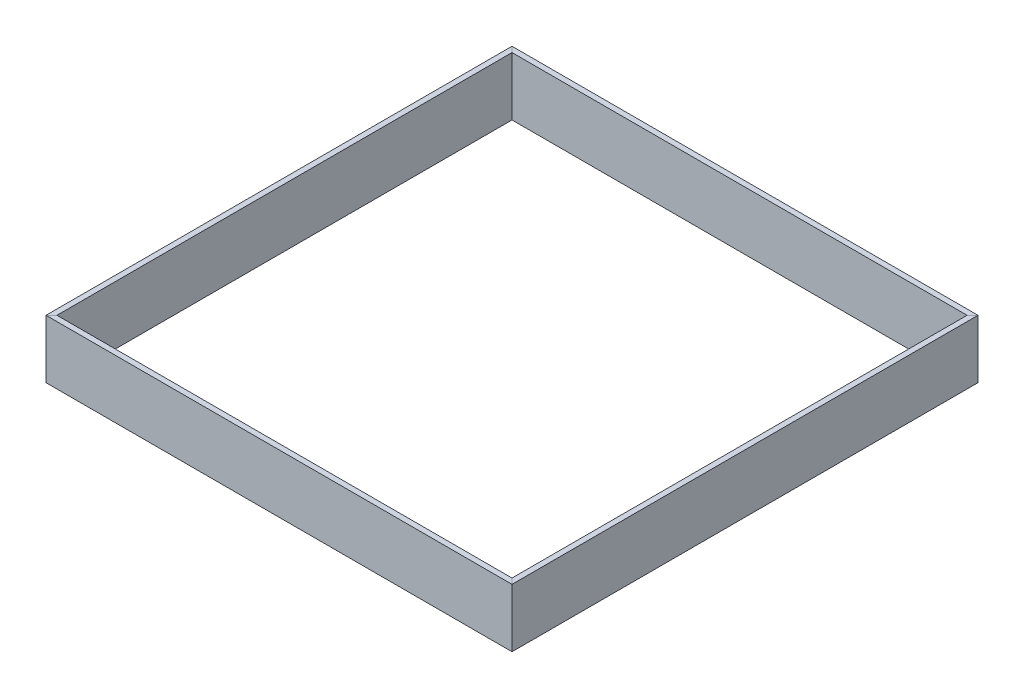
ISO-10303-21;
HEADER;
FILE_DESCRIPTION(('STEP AP214'),'2;1');
FILE_NAME('part.step','',(''),(''),'','','');
FILE_SCHEMA(('AUTOMOTIVE_DESIGN { 1 0 10303 214 1 1 1 1 }'));
ENDSEC;
DATA;
#1=APPLICATION_CONTEXT('core data for automotive mechanical design processes');
#2=APPLICATION_PROTOCOL_DEFINITION('international standard','automotive_design',2000,#1);
#3=PRODUCT_CONTEXT('',#1,'mechanical');
#4=PRODUCT('Part','Part','',(#3));
#5=PRODUCT_RELATED_PRODUCT_CATEGORY('part','',(#4));
#6=PRODUCT_DEFINITION_FORMATION('','',#4);
#7=PRODUCT_DEFINITION_CONTEXT('part definition',#1,'design');
#8=PRODUCT_DEFINITION('design','',#6,#7);
#9=PRODUCT_DEFINITION_SHAPE('','',#8);
#10=(LENGTH_UNIT() NAMED_UNIT(*) SI_UNIT(.MILLI.,.METRE.));
#11=(NAMED_UNIT(*) PLANE_ANGLE_UNIT() SI_UNIT($,.RADIAN.));
#12=(NAMED_UNIT(*) SI_UNIT($,.STERADIAN.) SOLID_ANGLE_UNIT());
#13=UNCERTAINTY_MEASURE_WITH_UNIT(LENGTH_MEASURE(1.E-05),#10,'distance_accuracy_value','');
#14=(GEOMETRIC_REPRESENTATION_CONTEXT(3) GLOBAL_UNCERTAINTY_ASSIGNED_CONTEXT((#13)) GLOBAL_UNIT_ASSIGNED_CONTEXT((#10,
#11,#12)) REPRESENTATION_CONTEXT('',''));
#15=CARTESIAN_POINT('',(0.,0.,0.));
#16=DIRECTION('',(0.,0.,1.));
#17=DIRECTION('',(1.,0.,0.));
#18=AXIS2_PLACEMENT_3D('',#15,#16,#17);
#19=CARTESIAN_POINT('',(-400.62,0.,400.62));
#20=DIRECTION('',(0.707106781186548,0.,0.707106781186548));
#21=DIRECTION('',(0.,-1.,0.));
#22=AXIS2_PLACEMENT_3D('',#19,#20,#21);
#23=PLANE('',#22);
#24=DIRECTION('',(-0.707106781186548,0.,0.707106781186548));
#25=VECTOR('',#24,1.);
#26=CARTESIAN_POINT('',(-2.38124999999989,50.8,2.38124999999995));
#27=LINE('',#26,#25);
#28=CARTESIAN_POINT('',(-395.8575,50.8,395.8575));
#29=VERTEX_POINT('',#28);
#30=CARTESIAN_POINT('',(-405.3825,50.8,405.3825));
#31=VERTEX_POINT('',#30);
#32=EDGE_CURVE('P0_E92',#29,#31,#27,.T.);
#33=ORIENTED_EDGE('',*,*,#32,.T.);
#34=DIRECTION('',(0.,-1.,0.));
#35=VECTOR('',#34,1.);
#36=CARTESIAN_POINT('',(-405.3825,50.8,405.3825));
#37=LINE('',#36,#35);
#38=CARTESIAN_POINT('',(-405.3825,-50.8,405.3825));
#39=VERTEX_POINT('',#38);
#40=EDGE_CURVE('P0_E103',#31,#39,#37,.T.);
#41=ORIENTED_EDGE('',*,*,#40,.T.);
#42=DIRECTION('',(0.707106781186548,0.,-0.707106781186548));
#43=VECTOR('',#42,1.);
#44=CARTESIAN_POINT('',(2.38125000000012,-50.8,-2.38125000000006));
#45=LINE('',#44,#43);
#46=CARTESIAN_POINT('',(-395.8575,-50.8,395.8575));
#47=VERTEX_POINT('',#46);
#48=EDGE_CURVE('P0_E27',#39,#47,#45,.T.);
#49=ORIENTED_EDGE('',*,*,#48,.T.);
#50=DIRECTION('',(0.,1.,0.));
#51=VECTOR('',#50,1.);
#52=CARTESIAN_POINT('',(-395.8575,-50.8,395.8575));
#53=LINE('',#52,#51);
#54=EDGE_CURVE('P0_E62',#47,#29,#53,.T.);
#55=ORIENTED_EDGE('',*,*,#54,.T.);
#56=EDGE_LOOP('',(#33,#41,#49,#55));
#57=FACE_BOUND('',#56,.T.);
#58=ADVANCED_FACE('P0_F17',(#57),#23,.T.);
#59=CARTESIAN_POINT('',(-400.62,0.,-400.62));
#60=DIRECTION('',(0.707106781186548,0.,-0.707106781186548));
#61=DIRECTION('',(0.,-1.,0.));
#62=AXIS2_PLACEMENT_3D('',#59,#60,#61);
#63=PLANE('',#62);
#64=DIRECTION('',(-0.707106781186548,0.,-0.707106781186548));
#65=VECTOR('',#64,1.);
#66=CARTESIAN_POINT('',(-398.23875,-50.8,-398.23875));
#67=LINE('',#66,#65);
#68=CARTESIAN_POINT('',(-395.8575,-50.8,-395.8575));
#69=VERTEX_POINT('',#68);
#70=CARTESIAN_POINT('',(-405.3825,-50.8,-405.3825));
#71=VERTEX_POINT('',#70);
#72=EDGE_CURVE('P0_E11',#69,#71,#67,.T.);
#73=ORIENTED_EDGE('',*,*,#72,.T.);
#74=DIRECTION('',(0.,1.,0.));
#75=VECTOR('',#74,1.);
#76=CARTESIAN_POINT('',(-405.3825,50.8,-405.3825));
#77=LINE('',#76,#75);
#78=CARTESIAN_POINT('',(-405.3825,50.8,-405.3825));
#79=VERTEX_POINT('',#78);
#80=EDGE_CURVE('P0_E85',#71,#79,#77,.T.);
#81=ORIENTED_EDGE('',*,*,#80,.T.);
#82=DIRECTION('',(0.707106781186548,0.,0.707106781186548));
#83=VECTOR('',#82,1.);
#84=CARTESIAN_POINT('',(-403.00125,50.8,-403.00125));
#85=LINE('',#84,#83);
#86=CARTESIAN_POINT('',(-395.8575,50.8,-395.8575));
#87=VERTEX_POINT('',#86);
#88=EDGE_CURVE('P0_E82',#79,#87,#85,.T.);
#89=ORIENTED_EDGE('',*,*,#88,.T.);
#90=DIRECTION('',(0.,-1.,0.));
#91=VECTOR('',#90,1.);
#92=CARTESIAN_POINT('',(-395.8575,-50.8,-395.8575));
#93=LINE('',#92,#91);
#94=EDGE_CURVE('P0_E70',#87,#69,#93,.T.);
#95=ORIENTED_EDGE('',*,*,#94,.T.);
#96=EDGE_LOOP('',(#73,#81,#89,#95));
#97=FACE_BOUND('',#96,.T.);
#98=ADVANCED_FACE('P0_F83',(#97),#63,.T.);
#99=CARTESIAN_POINT('',(-395.8575,-50.8,-400.62));
#100=DIRECTION('',(0.,1.,0.));
#101=DIRECTION('',(1.,0.,0.));
#102=AXIS2_PLACEMENT_3D('',#99,#100,#101);
#103=PLANE('',#102);
#104=ORIENTED_EDGE('',*,*,#48,.F.);
#105=DIRECTION('',(0.,0.,1.));
#106=VECTOR('',#105,1.);
#107=CARTESIAN_POINT('',(-405.3825,-50.8,-400.62));
#108=LINE('',#107,#106);
#109=EDGE_CURVE('P0_E100',#71,#39,#108,.T.);
#110=ORIENTED_EDGE('',*,*,#109,.F.);
#111=ORIENTED_EDGE('',*,*,#72,.F.);
#112=DIRECTION('',(0.,0.,1.));
#113=VECTOR('',#112,1.);
#114=CARTESIAN_POINT('',(-395.8575,-50.8,-400.62));
#115=LINE('',#114,#113);
#116=EDGE_CURVE('P0_E76',#69,#47,#115,.T.);
#117=ORIENTED_EDGE('',*,*,#116,.T.);
#118=EDGE_LOOP('',(#104,#110,#111,#117));
#119=FACE_BOUND('',#118,.T.);
#120=ADVANCED_FACE('P0_F19',(#119),#103,.F.);
#121=CARTESIAN_POINT('',(-395.8575,-50.8,-400.62));
#122=DIRECTION('',(-1.,0.,0.));
#123=DIRECTION('',(0.,0.,1.));
#124=AXIS2_PLACEMENT_3D('',#121,#122,#123);
#125=PLANE('',#124);
#126=ORIENTED_EDGE('',*,*,#54,.F.);
#127=ORIENTED_EDGE('',*,*,#116,.F.);
#128=ORIENTED_EDGE('',*,*,#94,.F.);
#129=DIRECTION('',(0.,0.,1.));
#130=VECTOR('',#129,1.);
#131=CARTESIAN_POINT('',(-395.8575,50.8,-400.62));
#132=LINE('',#131,#130);
#133=EDGE_CURVE('P0_E74',#87,#29,#132,.T.);
#134=ORIENTED_EDGE('',*,*,#133,.T.);
#135=EDGE_LOOP('',(#126,#127,#128,#134));
#136=FACE_BOUND('',#135,.T.);
#137=ADVANCED_FACE('P0_F72',(#136),#125,.F.);
#138=CARTESIAN_POINT('',(-405.3825,50.8,-400.62));
#139=DIRECTION('',(0.,-1.,0.));
#140=DIRECTION('',(0.,0.,-1.));
#141=AXIS2_PLACEMENT_3D('',#138,#139,#140);
#142=PLANE('',#141);
#143=ORIENTED_EDGE('',*,*,#32,.F.);
#144=ORIENTED_EDGE('',*,*,#133,.F.);
#145=ORIENTED_EDGE('',*,*,#88,.F.);
#146=DIRECTION('',(0.,0.,1.));
#147=VECTOR('',#146,1.);
#148=CARTESIAN_POINT('',(-405.3825,50.8,-400.62));
#149=LINE('',#148,#147);
#150=EDGE_CURVE('P0_E110',#79,#31,#149,.T.);
#151=ORIENTED_EDGE('',*,*,#150,.T.);
#152=EDGE_LOOP('',(#143,#144,#145,#151));
#153=FACE_BOUND('',#152,.T.);
#154=ADVANCED_FACE('P0_F91',(#153),#142,.F.);
#155=CARTESIAN_POINT('',(-405.3825,50.8,-400.62));
#156=DIRECTION('',(1.,0.,0.));
#157=DIRECTION('',(0.,1.,0.));
#158=AXIS2_PLACEMENT_3D('',#155,#156,#157);
#159=PLANE('',#158);
#160=ORIENTED_EDGE('',*,*,#40,.F.);
#161=ORIENTED_EDGE('',*,*,#150,.F.);
#162=ORIENTED_EDGE('',*,*,#80,.F.);
#163=ORIENTED_EDGE('',*,*,#109,.T.);
#164=EDGE_LOOP('',(#160,#161,#162,#163));
#165=FACE_BOUND('',#164,.T.);
#166=ADVANCED_FACE('P0_F123',(#165),#159,.F.);
#167=CLOSED_SHELL('',(#58,#98,#120,#137,#154,#166));
#168=MANIFOLD_SOLID_BREP('P0_B1',#167);
#169=CARTESIAN_POINT('',(-400.62,0.,-400.62));
#170=DIRECTION('',(-0.707106781186548,0.,0.707106781186548));
#171=DIRECTION('',(0.,1.,0.));
#172=AXIS2_PLACEMENT_3D('',#169,#170,#171);
#173=PLANE('',#172);
#174=DIRECTION('',(-0.707106781186548,0.,-0.707106781186548));
#175=VECTOR('',#174,1.);
#176=CARTESIAN_POINT('',(-2.38125,50.8,-2.38125));
#177=LINE('',#176,#175);
#178=CARTESIAN_POINT('',(-395.8575,50.8,-395.8575));
#179=VERTEX_POINT('',#178);
#180=CARTESIAN_POINT('',(-405.3825,50.8,-405.3825));
#181=VERTEX_POINT('',#180);
#182=EDGE_CURVE('P1_E72',#179,#181,#177,.T.);
#183=ORIENTED_EDGE('',*,*,#182,.T.);
#184=DIRECTION('',(0.,-1.,0.));
#185=VECTOR('',#184,1.);
#186=CARTESIAN_POINT('',(-405.3825,50.8,-405.3825));
#187=LINE('',#186,#185);
#188=CARTESIAN_POINT('',(-405.3825,-50.8,-405.3825));
#189=VERTEX_POINT('',#188);
#190=EDGE_CURVE('P1_E106',#181,#189,#187,.T.);
#191=ORIENTED_EDGE('',*,*,#190,.T.);
#192=DIRECTION('',(0.707106781186548,0.,0.707106781186548));
#193=VECTOR('',#192,1.);
#194=CARTESIAN_POINT('',(2.38125,-50.8,2.38125));
#195=LINE('',#194,#193);
#196=CARTESIAN_POINT('',(-395.8575,-50.8,-395.8575));
#197=VERTEX_POINT('',#196);
#198=EDGE_CURVE('P1_E28',#189,#197,#195,.T.);
#199=ORIENTED_EDGE('',*,*,#198,.T.);
#200=DIRECTION('',(0.,1.,0.));
#201=VECTOR('',#200,1.);
#202=CARTESIAN_POINT('',(-395.8575,-50.8,-395.8575));
#203=LINE('',#202,#201);
#204=EDGE_CURVE('P1_E69',#197,#179,#203,.T.);
#205=ORIENTED_EDGE('',*,*,#204,.T.);
#206=EDGE_LOOP('',(#183,#191,#199,#205));
#207=FACE_BOUND('',#206,.T.);
#208=ADVANCED_FACE('P1_F17',(#207),#173,.T.);
#209=CARTESIAN_POINT('',(400.62,0.,-400.62));
#210=DIRECTION('',(0.707106781186548,0.,0.707106781186548));
#211=DIRECTION('',(0.,-1.,0.));
#212=AXIS2_PLACEMENT_3D('',#209,#210,#211);
#213=PLANE('',#212);
#214=DIRECTION('',(0.707106781186548,0.,-0.707106781186548));
#215=VECTOR('',#214,1.);
#216=CARTESIAN_POINT('',(398.23875,-50.8,-398.23875));
#217=LINE('',#216,#215);
#218=CARTESIAN_POINT('',(395.8575,-50.8,-395.8575));
#219=VERTEX_POINT('',#218);
#220=CARTESIAN_POINT('',(405.3825,-50.8,-405.3825));
#221=VERTEX_POINT('',#220);
#222=EDGE_CURVE('P1_E11',#219,#221,#217,.T.);
#223=ORIENTED_EDGE('',*,*,#222,.T.);
#224=DIRECTION('',(0.,1.,0.));
#225=VECTOR('',#224,1.);
#226=CARTESIAN_POINT('',(405.3825,50.8,-405.3825));
#227=LINE('',#226,#225);
#228=CARTESIAN_POINT('',(405.3825,50.8,-405.3825));
#229=VERTEX_POINT('',#228);
#230=EDGE_CURVE('P1_E96',#221,#229,#227,.T.);
#231=ORIENTED_EDGE('',*,*,#230,.T.);
#232=DIRECTION('',(-0.707106781186548,0.,0.707106781186548));
#233=VECTOR('',#232,1.);
#234=CARTESIAN_POINT('',(403.00125,50.8,-403.00125));
#235=LINE('',#234,#233);
#236=CARTESIAN_POINT('',(395.8575,50.8,-395.8575));
#237=VERTEX_POINT('',#236);
#238=EDGE_CURVE('P1_E77',#229,#237,#235,.T.);
#239=ORIENTED_EDGE('',*,*,#238,.T.);
#240=DIRECTION('',(0.,-1.,0.));
#241=VECTOR('',#240,1.);
#242=CARTESIAN_POINT('',(395.8575,-50.8,-395.8575));
#243=LINE('',#242,#241);
#244=EDGE_CURVE('P1_E21',#237,#219,#243,.T.);
#245=ORIENTED_EDGE('',*,*,#244,.T.);
#246=EDGE_LOOP('',(#223,#231,#239,#245));
#247=FACE_BOUND('',#246,.T.);
#248=ADVANCED_FACE('P1_F115',(#247),#213,.T.);
#249=CARTESIAN_POINT('',(400.62,-50.8,-395.8575));
#250=DIRECTION('',(0.,1.,0.));
#251=DIRECTION('',(1.,0.,0.));
#252=AXIS2_PLACEMENT_3D('',#249,#250,#251);
#253=PLANE('',#252);
#254=ORIENTED_EDGE('',*,*,#198,.F.);
#255=DIRECTION('',(-1.,0.,0.));
#256=VECTOR('',#255,1.);
#257=CARTESIAN_POINT('',(400.62,-50.8,-405.3825));
#258=LINE('',#257,#256);
#259=EDGE_CURVE('P1_E89',#221,#189,#258,.T.);
#260=ORIENTED_EDGE('',*,*,#259,.F.);
#261=ORIENTED_EDGE('',*,*,#222,.F.);
#262=DIRECTION('',(-1.,0.,0.));
#263=VECTOR('',#262,1.);
#264=CARTESIAN_POINT('',(400.62,-50.8,-395.8575));
#265=LINE('',#264,#263);
#266=EDGE_CURVE('P1_E76',#219,#197,#265,.T.);
#267=ORIENTED_EDGE('',*,*,#266,.T.);
#268=EDGE_LOOP('',(#254,#260,#261,#267));
#269=FACE_BOUND('',#268,.T.);
#270=ADVANCED_FACE('P1_F124',(#269),#253,.F.);
#271=CARTESIAN_POINT('',(400.62,-50.8,-395.8575));
#272=DIRECTION('',(0.,0.,-1.));
#273=DIRECTION('',(0.,-1.,0.));
#274=AXIS2_PLACEMENT_3D('',#271,#272,#273);
#275=PLANE('',#274);
#276=ORIENTED_EDGE('',*,*,#204,.F.);
#277=ORIENTED_EDGE('',*,*,#266,.F.);
#278=ORIENTED_EDGE('',*,*,#244,.F.);
#279=DIRECTION('',(-1.,0.,0.));
#280=VECTOR('',#279,1.);
#281=CARTESIAN_POINT('',(400.62,50.8,-395.8575));
#282=LINE('',#281,#280);
#283=EDGE_CURVE('P1_E79',#237,#179,#282,.T.);
#284=ORIENTED_EDGE('',*,*,#283,.T.);
#285=EDGE_LOOP('',(#276,#277,#278,#284));
#286=FACE_BOUND('',#285,.T.);
#287=ADVANCED_FACE('P1_F19',(#286),#275,.F.);
#288=CARTESIAN_POINT('',(400.62,50.8,-405.3825));
#289=DIRECTION('',(0.,-1.,0.));
#290=DIRECTION('',(0.,0.,-1.));
#291=AXIS2_PLACEMENT_3D('',#288,#289,#290);
#292=PLANE('',#291);
#293=ORIENTED_EDGE('',*,*,#182,.F.);
#294=ORIENTED_EDGE('',*,*,#283,.F.);
#295=ORIENTED_EDGE('',*,*,#238,.F.);
#296=DIRECTION('',(-1.,0.,0.));
#297=VECTOR('',#296,1.);
#298=CARTESIAN_POINT('',(400.62,50.8,-405.3825));
#299=LINE('',#298,#297);
#300=EDGE_CURVE('P1_E86',#229,#181,#299,.T.);
#301=ORIENTED_EDGE('',*,*,#300,.T.);
#302=EDGE_LOOP('',(#293,#294,#295,#301));
#303=FACE_BOUND('',#302,.T.);
#304=ADVANCED_FACE('P1_F84',(#303),#292,.F.);
#305=CARTESIAN_POINT('',(400.62,50.8,-405.3825));
#306=DIRECTION('',(0.,0.,1.));
#307=DIRECTION('',(1.,0.,0.));
#308=AXIS2_PLACEMENT_3D('',#305,#306,#307);
#309=PLANE('',#308);
#310=ORIENTED_EDGE('',*,*,#190,.F.);
#311=ORIENTED_EDGE('',*,*,#300,.F.);
#312=ORIENTED_EDGE('',*,*,#230,.F.);
#313=ORIENTED_EDGE('',*,*,#259,.T.);
#314=EDGE_LOOP('',(#310,#311,#312,#313));
#315=FACE_BOUND('',#314,.T.);
#316=ADVANCED_FACE('P1_F118',(#315),#309,.F.);
#317=CLOSED_SHELL('',(#208,#248,#270,#287,#304,#316));
#318=MANIFOLD_SOLID_BREP('P1_B1',#317);
#319=CARTESIAN_POINT('',(400.62,0.,-400.62));
#320=DIRECTION('',(-0.707106781186548,0.,-0.707106781186548));
#321=DIRECTION('',(-0.707106781186548,0.,0.707106781186548));
#322=AXIS2_PLACEMENT_3D('',#319,#320,#321);
#323=PLANE('',#322);
#324=DIRECTION('',(0.707106781186548,0.,-0.707106781186548));
#325=VECTOR('',#324,1.);
#326=CARTESIAN_POINT('',(2.38125000000006,50.8,-2.38124999999984));
#327=LINE('',#326,#325);
#328=CARTESIAN_POINT('',(395.8575,50.8,-395.8575));
#329=VERTEX_POINT('',#328);
#330=CARTESIAN_POINT('',(405.3825,50.8,-405.3825));
#331=VERTEX_POINT('',#330);
#332=EDGE_CURVE('P2_E21',#329,#331,#327,.T.);
#333=ORIENTED_EDGE('',*,*,#332,.T.);
#334=DIRECTION('',(0.,-1.,0.));
#335=VECTOR('',#334,1.);
#336=CARTESIAN_POINT('',(405.3825,50.8,-405.3825));
#337=LINE('',#336,#335);
#338=CARTESIAN_POINT('',(405.3825,-50.8,-405.3825));
#339=VERTEX_POINT('',#338);
#340=EDGE_CURVE('P2_E86',#331,#339,#337,.T.);
#341=ORIENTED_EDGE('',*,*,#340,.T.);
#342=DIRECTION('',(-0.707106781186548,0.,0.707106781186548));
#343=VECTOR('',#342,1.);
#344=CARTESIAN_POINT('',(-2.38124999999995,-50.8,2.38125000000017));
#345=LINE('',#344,#343);
#346=CARTESIAN_POINT('',(395.8575,-50.8,-395.8575));
#347=VERTEX_POINT('',#346);
#348=EDGE_CURVE('P2_E27',#339,#347,#345,.T.);
#349=ORIENTED_EDGE('',*,*,#348,.T.);
#350=DIRECTION('',(0.,1.,0.));
#351=VECTOR('',#350,1.);
#352=CARTESIAN_POINT('',(395.8575,-50.8,-395.8575));
#353=LINE('',#352,#351);
#354=EDGE_CURVE('P2_E108',#347,#329,#353,.T.);
#355=ORIENTED_EDGE('',*,*,#354,.T.);
#356=EDGE_LOOP('',(#333,#341,#349,#355));
#357=FACE_BOUND('',#356,.T.);
#358=ADVANCED_FACE('P2_F17',(#357),#323,.T.);
#359=CARTESIAN_POINT('',(400.62,0.,400.62));
#360=DIRECTION('',(-0.707106781186547,0.,0.707106781186548));
#361=DIRECTION('',(0.,1.,0.));
#362=AXIS2_PLACEMENT_3D('',#359,#360,#361);
#363=PLANE('',#362);
#364=DIRECTION('',(0.707106781186548,0.,0.707106781186547));
#365=VECTOR('',#364,1.);
#366=CARTESIAN_POINT('',(398.23875,-50.8,398.23875));
#367=LINE('',#366,#365);
#368=CARTESIAN_POINT('',(395.8575,-50.8,395.8575));
#369=VERTEX_POINT('',#368);
#370=CARTESIAN_POINT('',(405.3825,-50.8,405.3825));
#371=VERTEX_POINT('',#370);
#372=EDGE_CURVE('P2_E11',#369,#371,#367,.T.);
#373=ORIENTED_EDGE('',*,*,#372,.T.);
#374=DIRECTION('',(0.,1.,0.));
#375=VECTOR('',#374,1.);
#376=CARTESIAN_POINT('',(405.3825,50.8,405.3825));
#377=LINE('',#376,#375);
#378=CARTESIAN_POINT('',(405.3825,50.8,405.3825));
#379=VERTEX_POINT('',#378);
#380=EDGE_CURVE('P2_E88',#371,#379,#377,.T.);
#381=ORIENTED_EDGE('',*,*,#380,.T.);
#382=DIRECTION('',(-0.707106781186548,0.,-0.707106781186547));
#383=VECTOR('',#382,1.);
#384=CARTESIAN_POINT('',(403.00125,50.8,403.00125));
#385=LINE('',#384,#383);
#386=CARTESIAN_POINT('',(395.8575,50.8,395.8575));
#387=VERTEX_POINT('',#386);
#388=EDGE_CURVE('P2_E109',#379,#387,#385,.T.);
#389=ORIENTED_EDGE('',*,*,#388,.T.);
#390=DIRECTION('',(0.,-1.,0.));
#391=VECTOR('',#390,1.);
#392=CARTESIAN_POINT('',(395.8575,-50.8,395.8575));
#393=LINE('',#392,#391);
#394=EDGE_CURVE('P2_E80',#387,#369,#393,.T.);
#395=ORIENTED_EDGE('',*,*,#394,.T.);
#396=EDGE_LOOP('',(#373,#381,#389,#395));
#397=FACE_BOUND('',#396,.T.);
#398=ADVANCED_FACE('P2_F117',(#397),#363,.T.);
#399=CARTESIAN_POINT('',(395.8575,-50.8,400.62));
#400=DIRECTION('',(0.,1.,0.));
#401=DIRECTION('',(1.,0.,0.));
#402=AXIS2_PLACEMENT_3D('',#399,#400,#401);
#403=PLANE('',#402);
#404=ORIENTED_EDGE('',*,*,#348,.F.);
#405=DIRECTION('',(0.,0.,-1.));
#406=VECTOR('',#405,1.);
#407=CARTESIAN_POINT('',(405.3825,-50.8,400.62));
#408=LINE('',#407,#406);
#409=EDGE_CURVE('P2_E74',#371,#339,#408,.T.);
#410=ORIENTED_EDGE('',*,*,#409,.F.);
#411=ORIENTED_EDGE('',*,*,#372,.F.);
#412=DIRECTION('',(0.,0.,-1.));
#413=VECTOR('',#412,1.);
#414=CARTESIAN_POINT('',(395.8575,-50.8,400.62));
#415=LINE('',#414,#413);
#416=EDGE_CURVE('P2_E77',#369,#347,#415,.T.);
#417=ORIENTED_EDGE('',*,*,#416,.T.);
#418=EDGE_LOOP('',(#404,#410,#411,#417));
#419=FACE_BOUND('',#418,.T.);
#420=ADVANCED_FACE('P2_F73',(#419),#403,.F.);
#421=CARTESIAN_POINT('',(395.8575,-50.8,400.62));
#422=DIRECTION('',(1.,0.,0.));
#423=DIRECTION('',(0.,1.,0.));
#424=AXIS2_PLACEMENT_3D('',#421,#422,#423);
#425=PLANE('',#424);
#426=ORIENTED_EDGE('',*,*,#354,.F.);
#427=ORIENTED_EDGE('',*,*,#416,.F.);
#428=ORIENTED_EDGE('',*,*,#394,.F.);
#429=DIRECTION('',(0.,0.,-1.));
#430=VECTOR('',#429,1.);
#431=CARTESIAN_POINT('',(395.8575,50.8,400.62));
#432=LINE('',#431,#430);
#433=EDGE_CURVE('P2_E104',#387,#329,#432,.T.);
#434=ORIENTED_EDGE('',*,*,#433,.T.);
#435=EDGE_LOOP('',(#426,#427,#428,#434));
#436=FACE_BOUND('',#435,.T.);
#437=ADVANCED_FACE('P2_F136',(#436),#425,.F.);
#438=CARTESIAN_POINT('',(405.3825,50.8,400.62));
#439=DIRECTION('',(0.,-1.,0.));
#440=DIRECTION('',(0.,0.,-1.));
#441=AXIS2_PLACEMENT_3D('',#438,#439,#440);
#442=PLANE('',#441);
#443=ORIENTED_EDGE('',*,*,#332,.F.);
#444=ORIENTED_EDGE('',*,*,#433,.F.);
#445=ORIENTED_EDGE('',*,*,#388,.F.);
#446=DIRECTION('',(0.,0.,-1.));
#447=VECTOR('',#446,1.);
#448=CARTESIAN_POINT('',(405.3825,50.8,400.62));
#449=LINE('',#448,#447);
#450=EDGE_CURVE('P2_E94',#379,#331,#449,.T.);
#451=ORIENTED_EDGE('',*,*,#450,.T.);
#452=EDGE_LOOP('',(#443,#444,#445,#451));
#453=FACE_BOUND('',#452,.T.);
#454=ADVANCED_FACE('P2_F19',(#453),#442,.F.);
#455=CARTESIAN_POINT('',(405.3825,50.8,400.62));
#456=DIRECTION('',(-1.,0.,0.));
#457=DIRECTION('',(0.,0.,1.));
#458=AXIS2_PLACEMENT_3D('',#455,#456,#457);
#459=PLANE('',#458);
#460=ORIENTED_EDGE('',*,*,#340,.F.);
#461=ORIENTED_EDGE('',*,*,#450,.F.);
#462=ORIENTED_EDGE('',*,*,#380,.F.);
#463=ORIENTED_EDGE('',*,*,#409,.T.);
#464=EDGE_LOOP('',(#460,#461,#462,#463));
#465=FACE_BOUND('',#464,.T.);
#466=ADVANCED_FACE('P2_F84',(#465),#459,.F.);
#467=CLOSED_SHELL('',(#358,#398,#420,#437,#454,#466));
#468=MANIFOLD_SOLID_BREP('P2_B1',#467);
#469=CARTESIAN_POINT('',(-400.62,0.,400.62));
#470=DIRECTION('',(-0.707106781186548,0.,-0.707106781186548));
#471=DIRECTION('',(-0.707106781186548,0.,0.707106781186548));
#472=AXIS2_PLACEMENT_3D('',#469,#470,#471);
#473=PLANE('',#472);
#474=DIRECTION('',(-0.707106781186548,0.,0.707106781186548));
#475=VECTOR('',#474,1.);
#476=CARTESIAN_POINT('',(-398.23875,-50.8,398.23875));
#477=LINE('',#476,#475);
#478=CARTESIAN_POINT('',(-395.8575,-50.8,395.8575));
#479=VERTEX_POINT('',#478);
#480=CARTESIAN_POINT('',(-405.3825,-50.8,405.3825));
#481=VERTEX_POINT('',#480);
#482=EDGE_CURVE('P3_E26',#479,#481,#477,.T.);
#483=ORIENTED_EDGE('',*,*,#482,.T.);
#484=DIRECTION('',(0.,1.,0.));
#485=VECTOR('',#484,1.);
#486=CARTESIAN_POINT('',(-405.3825,50.8,405.3825));
#487=LINE('',#486,#485);
#488=CARTESIAN_POINT('',(-405.3825,50.8,405.3825));
#489=VERTEX_POINT('',#488);
#490=EDGE_CURVE('P3_E97',#481,#489,#487,.T.);
#491=ORIENTED_EDGE('',*,*,#490,.T.);
#492=DIRECTION('',(0.707106781186548,0.,-0.707106781186548));
#493=VECTOR('',#492,1.);
#494=CARTESIAN_POINT('',(-403.00125,50.8,403.00125));
#495=LINE('',#494,#493);
#496=CARTESIAN_POINT('',(-395.8575,50.8,395.8575));
#497=VERTEX_POINT('',#496);
#498=EDGE_CURVE('P3_E87',#489,#497,#495,.T.);
#499=ORIENTED_EDGE('',*,*,#498,.T.);
#500=DIRECTION('',(0.,-1.,0.));
#501=VECTOR('',#500,1.);
#502=CARTESIAN_POINT('',(-395.8575,-50.8,395.8575));
#503=LINE('',#502,#501);
#504=EDGE_CURVE('P3_E73',#497,#479,#503,.T.);
#505=ORIENTED_EDGE('',*,*,#504,.T.);
#506=EDGE_LOOP('',(#483,#491,#499,#505));
#507=FACE_BOUND('',#506,.T.);
#508=ADVANCED_FACE('P3_F17',(#507),#473,.T.);
#509=CARTESIAN_POINT('',(400.62,0.,400.62));
#510=DIRECTION('',(0.707106781186548,0.,-0.707106781186548));
#511=DIRECTION('',(0.,-1.,0.));
#512=AXIS2_PLACEMENT_3D('',#509,#510,#511);
#513=PLANE('',#512);
#514=DIRECTION('',(0.707106781186548,0.,0.707106781186548));
#515=VECTOR('',#514,1.);
#516=CARTESIAN_POINT('',(2.38124999999989,50.8,2.38125));
#517=LINE('',#516,#515);
#518=CARTESIAN_POINT('',(395.8575,50.8,395.8575));
#519=VERTEX_POINT('',#518);
#520=CARTESIAN_POINT('',(405.3825,50.8,405.3825));
#521=VERTEX_POINT('',#520);
#522=EDGE_CURVE('P3_E67',#519,#521,#517,.T.);
#523=ORIENTED_EDGE('',*,*,#522,.T.);
#524=DIRECTION('',(0.,-1.,0.));
#525=VECTOR('',#524,1.);
#526=CARTESIAN_POINT('',(405.3825,50.8,405.3825));
#527=LINE('',#526,#525);
#528=CARTESIAN_POINT('',(405.3825,-50.8,405.3825));
#529=VERTEX_POINT('',#528);
#530=EDGE_CURVE('P3_E100',#521,#529,#527,.T.);
#531=ORIENTED_EDGE('',*,*,#530,.T.);
#532=DIRECTION('',(-0.707106781186548,0.,-0.707106781186548));
#533=VECTOR('',#532,1.);
#534=CARTESIAN_POINT('',(-2.38125000000012,-50.8,-2.38125000000006));
#535=LINE('',#534,#533);
#536=CARTESIAN_POINT('',(395.8575,-50.8,395.8575));
#537=VERTEX_POINT('',#536);
#538=EDGE_CURVE('P3_E11',#529,#537,#535,.T.);
#539=ORIENTED_EDGE('',*,*,#538,.T.);
#540=DIRECTION('',(0.,1.,0.));
#541=VECTOR('',#540,1.);
#542=CARTESIAN_POINT('',(395.8575,-50.8,395.8575));
#543=LINE('',#542,#541);
#544=EDGE_CURVE('P3_E63',#537,#519,#543,.T.);
#545=ORIENTED_EDGE('',*,*,#544,.T.);
#546=EDGE_LOOP('',(#523,#531,#539,#545));
#547=FACE_BOUND('',#546,.T.);
#548=ADVANCED_FACE('P3_F65',(#547),#513,.T.);
#549=CARTESIAN_POINT('',(-400.62,-50.8,395.8575));
#550=DIRECTION('',(0.,1.,0.));
#551=DIRECTION('',(1.,0.,0.));
#552=AXIS2_PLACEMENT_3D('',#549,#550,#551);
#553=PLANE('',#552);
#554=ORIENTED_EDGE('',*,*,#482,.F.);
#555=DIRECTION('',(1.,0.,0.));
#556=VECTOR('',#555,1.);
#557=CARTESIAN_POINT('',(-400.62,-50.8,395.8575));
#558=LINE('',#557,#556);
#559=EDGE_CURVE('P3_E72',#479,#537,#558,.T.);
#560=ORIENTED_EDGE('',*,*,#559,.T.);
#561=ORIENTED_EDGE('',*,*,#538,.F.);
#562=DIRECTION('',(1.,0.,0.));
#563=VECTOR('',#562,1.);
#564=CARTESIAN_POINT('',(-400.62,-50.8,405.3825));
#565=LINE('',#564,#563);
#566=EDGE_CURVE('P3_E106',#481,#529,#565,.T.);
#567=ORIENTED_EDGE('',*,*,#566,.F.);
#568=EDGE_LOOP('',(#554,#560,#561,#567));
#569=FACE_BOUND('',#568,.T.);
#570=ADVANCED_FACE('P3_F114',(#569),#553,.F.);
#571=CARTESIAN_POINT('',(-400.62,-50.8,395.8575));
#572=DIRECTION('',(0.,0.,1.));
#573=DIRECTION('',(1.,0.,0.));
#574=AXIS2_PLACEMENT_3D('',#571,#572,#573);
#575=PLANE('',#574);
#576=ORIENTED_EDGE('',*,*,#504,.F.);
#577=DIRECTION('',(1.,0.,0.));
#578=VECTOR('',#577,1.);
#579=CARTESIAN_POINT('',(-400.62,50.8,395.8575));
#580=LINE('',#579,#578);
#581=EDGE_CURVE('P3_E75',#497,#519,#580,.T.);
#582=ORIENTED_EDGE('',*,*,#581,.T.);
#583=ORIENTED_EDGE('',*,*,#544,.F.);
#584=ORIENTED_EDGE('',*,*,#559,.F.);
#585=EDGE_LOOP('',(#576,#582,#583,#584));
#586=FACE_BOUND('',#585,.T.);
#587=ADVANCED_FACE('P3_F76',(#586),#575,.F.);
#588=CARTESIAN_POINT('',(-400.62,50.8,405.3825));
#589=DIRECTION('',(0.,-1.,0.));
#590=DIRECTION('',(0.,0.,-1.));
#591=AXIS2_PLACEMENT_3D('',#588,#589,#590);
#592=PLANE('',#591);
#593=ORIENTED_EDGE('',*,*,#498,.F.);
#594=DIRECTION('',(1.,0.,0.));
#595=VECTOR('',#594,1.);
#596=CARTESIAN_POINT('',(-400.62,50.8,405.3825));
#597=LINE('',#596,#595);
#598=EDGE_CURVE('P3_E84',#489,#521,#597,.T.);
#599=ORIENTED_EDGE('',*,*,#598,.T.);
#600=ORIENTED_EDGE('',*,*,#522,.F.);
#601=ORIENTED_EDGE('',*,*,#581,.F.);
#602=EDGE_LOOP('',(#593,#599,#600,#601));
#603=FACE_BOUND('',#602,.T.);
#604=ADVANCED_FACE('P3_F82',(#603),#592,.F.);
#605=CARTESIAN_POINT('',(-400.62,50.8,405.3825));
#606=DIRECTION('',(0.,0.,-1.));
#607=DIRECTION('',(0.,-1.,0.));
#608=AXIS2_PLACEMENT_3D('',#605,#606,#607);
#609=PLANE('',#608);
#610=ORIENTED_EDGE('',*,*,#490,.F.);
#611=ORIENTED_EDGE('',*,*,#566,.T.);
#612=ORIENTED_EDGE('',*,*,#530,.F.);
#613=ORIENTED_EDGE('',*,*,#598,.F.);
#614=EDGE_LOOP('',(#610,#611,#612,#613));
#615=FACE_BOUND('',#614,.T.);
#616=ADVANCED_FACE('P3_F120',(#615),#609,.F.);
#617=CLOSED_SHELL('',(#508,#548,#570,#587,#604,#616));
#618=MANIFOLD_SOLID_BREP('P3_B1',#617);
#619=ADVANCED_BREP_SHAPE_REPRESENTATION('',(#18,#168,#318,#468,#618),#14);
#620=SHAPE_DEFINITION_REPRESENTATION(#9,#619);
ENDSEC;
END-ISO-10303-21;
